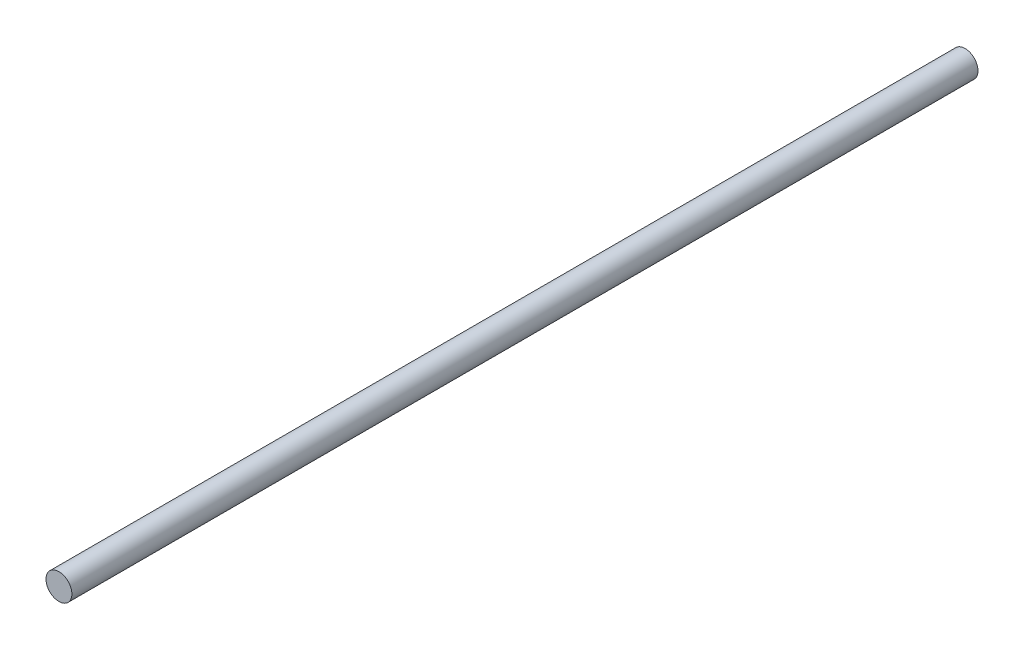
ISO-10303-21;
HEADER;
FILE_DESCRIPTION(('STEP AP214'),'2;1');
FILE_NAME('part.step','',(''),(''),'','','');
FILE_SCHEMA(('AUTOMOTIVE_DESIGN { 1 0 10303 214 1 1 1 1 }'));
ENDSEC;
DATA;
#1=APPLICATION_CONTEXT('core data for automotive mechanical design processes');
#2=APPLICATION_PROTOCOL_DEFINITION('international standard','automotive_design',2000,#1);
#3=PRODUCT_CONTEXT('',#1,'mechanical');
#4=PRODUCT('Part','Part','',(#3));
#5=PRODUCT_RELATED_PRODUCT_CATEGORY('part','',(#4));
#6=PRODUCT_DEFINITION_FORMATION('','',#4);
#7=PRODUCT_DEFINITION_CONTEXT('part definition',#1,'design');
#8=PRODUCT_DEFINITION('design','',#6,#7);
#9=PRODUCT_DEFINITION_SHAPE('','',#8);
#10=(LENGTH_UNIT() NAMED_UNIT(*) SI_UNIT(.MILLI.,.METRE.));
#11=(NAMED_UNIT(*) PLANE_ANGLE_UNIT() SI_UNIT($,.RADIAN.));
#12=(NAMED_UNIT(*) SI_UNIT($,.STERADIAN.) SOLID_ANGLE_UNIT());
#13=UNCERTAINTY_MEASURE_WITH_UNIT(LENGTH_MEASURE(1.E-05),#10,'distance_accuracy_value','');
#14=(GEOMETRIC_REPRESENTATION_CONTEXT(3) GLOBAL_UNCERTAINTY_ASSIGNED_CONTEXT((#13)) GLOBAL_UNIT_ASSIGNED_CONTEXT((#10,
#11,#12)) REPRESENTATION_CONTEXT('',''));
#15=CARTESIAN_POINT('',(0.,0.,0.));
#16=DIRECTION('',(0.,0.,1.));
#17=DIRECTION('',(1.,0.,0.));
#18=AXIS2_PLACEMENT_3D('',#15,#16,#17);
#19=CARTESIAN_POINT('',(0.,0.,420.));
#20=DIRECTION('',(0.,0.,-1.));
#21=DIRECTION('',(-1.,0.,0.));
#22=AXIS2_PLACEMENT_3D('',#19,#20,#21);
#23=CYLINDRICAL_SURFACE('',#22,6.);
#24=CARTESIAN_POINT('',(0.,0.,420.));
#25=DIRECTION('',(0.,0.,1.));
#26=DIRECTION('',(1.,0.,0.));
#27=AXIS2_PLACEMENT_3D('',#24,#25,#26);
#28=CIRCLE('',#27,6.);
#29=CARTESIAN_POINT('',(6.,0.,420.));
#30=VERTEX_POINT('',#29);
#31=EDGE_CURVE('E10',#30,#30,#28,.T.);
#32=ORIENTED_EDGE('',*,*,#31,.F.);
#33=EDGE_LOOP('',(#32));
#34=FACE_BOUND('',#33,.T.);
#35=CARTESIAN_POINT('',(0.,0.,0.));
#36=DIRECTION('',(0.,0.,1.));
#37=DIRECTION('',(1.,0.,0.));
#38=AXIS2_PLACEMENT_3D('',#35,#36,#37);
#39=CIRCLE('',#38,6.);
#40=CARTESIAN_POINT('',(6.,0.,0.));
#41=VERTEX_POINT('',#40);
#42=EDGE_CURVE('E34',#41,#41,#39,.T.);
#43=ORIENTED_EDGE('',*,*,#42,.T.);
#44=EDGE_LOOP('',(#43));
#45=FACE_BOUND('',#44,.T.);
#46=ADVANCED_FACE('F31',(#34,#45),#23,.T.);
#47=CARTESIAN_POINT('',(0.,0.,420.));
#48=DIRECTION('',(0.,0.,1.));
#49=DIRECTION('',(1.,0.,0.));
#50=AXIS2_PLACEMENT_3D('',#47,#48,#49);
#51=PLANE('',#50);
#52=ORIENTED_EDGE('',*,*,#31,.T.);
#53=EDGE_LOOP('',(#52));
#54=FACE_BOUND('',#53,.T.);
#55=ADVANCED_FACE('F46',(#54),#51,.T.);
#56=CARTESIAN_POINT('',(0.,0.,0.));
#57=DIRECTION('',(0.,0.,1.));
#58=DIRECTION('',(1.,0.,0.));
#59=AXIS2_PLACEMENT_3D('',#56,#57,#58);
#60=PLANE('',#59);
#61=ORIENTED_EDGE('',*,*,#42,.F.);
#62=EDGE_LOOP('',(#61));
#63=FACE_BOUND('',#62,.T.);
#64=ADVANCED_FACE('F44',(#63),#60,.F.);
#65=CLOSED_SHELL('',(#46,#55,#64));
#66=MANIFOLD_SOLID_BREP('B2',#65);
#67=ADVANCED_BREP_SHAPE_REPRESENTATION('',(#18,#66),#14);
#68=SHAPE_DEFINITION_REPRESENTATION(#9,#67);
ENDSEC;
END-ISO-10303-21;
